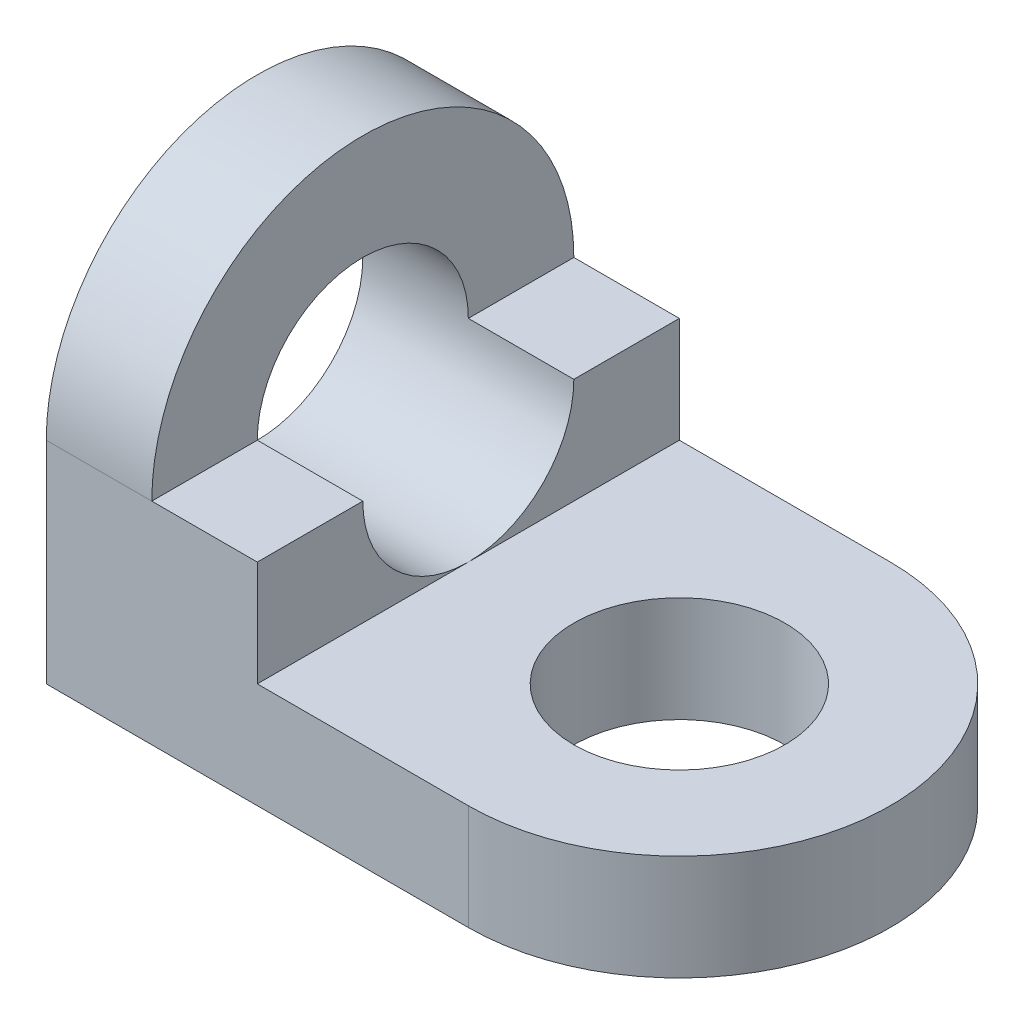
ISO-10303-21;
HEADER;
FILE_DESCRIPTION(('STEP AP214'),'2;1');
FILE_NAME('part.step','',(''),(''),'','','');
FILE_SCHEMA(('AUTOMOTIVE_DESIGN { 1 0 10303 214 1 1 1 1 }'));
ENDSEC;
DATA;
#1=APPLICATION_CONTEXT('core data for automotive mechanical design processes');
#2=APPLICATION_PROTOCOL_DEFINITION('international standard','automotive_design',2000,#1);
#3=PRODUCT_CONTEXT('',#1,'mechanical');
#4=PRODUCT('Part','Part','',(#3));
#5=PRODUCT_RELATED_PRODUCT_CATEGORY('part','',(#4));
#6=PRODUCT_DEFINITION_FORMATION('','',#4);
#7=PRODUCT_DEFINITION_CONTEXT('part definition',#1,'design');
#8=PRODUCT_DEFINITION('design','',#6,#7);
#9=PRODUCT_DEFINITION_SHAPE('','',#8);
#10=(LENGTH_UNIT() NAMED_UNIT(*) SI_UNIT(.MILLI.,.METRE.));
#11=(NAMED_UNIT(*) PLANE_ANGLE_UNIT() SI_UNIT($,.RADIAN.));
#12=(NAMED_UNIT(*) SI_UNIT($,.STERADIAN.) SOLID_ANGLE_UNIT());
#13=UNCERTAINTY_MEASURE_WITH_UNIT(LENGTH_MEASURE(1.E-05),#10,'distance_accuracy_value','');
#14=(GEOMETRIC_REPRESENTATION_CONTEXT(3) GLOBAL_UNCERTAINTY_ASSIGNED_CONTEXT((#13)) GLOBAL_UNIT_ASSIGNED_CONTEXT((#10,
#11,#12)) REPRESENTATION_CONTEXT('',''));
#15=CARTESIAN_POINT('',(0.,0.,0.));
#16=DIRECTION('',(0.,0.,1.));
#17=DIRECTION('',(1.,0.,0.));
#18=AXIS2_PLACEMENT_3D('',#15,#16,#17);
#19=CARTESIAN_POINT('',(1.,0.,0.));
#20=DIRECTION('',(1.,0.,0.));
#21=DIRECTION('',(0.,0.,-1.));
#22=AXIS2_PLACEMENT_3D('',#19,#20,#21);
#23=PLANE('',#22);
#24=DIRECTION('',(0.,0.,1.));
#25=VECTOR('',#24,1.);
#26=CARTESIAN_POINT('',(1.,2.,0.));
#27=LINE('',#26,#25);
#28=CARTESIAN_POINT('',(1.,2.,-2.));
#29=VERTEX_POINT('',#28);
#30=CARTESIAN_POINT('',(1.,2.,-1.));
#31=VERTEX_POINT('',#30);
#32=EDGE_CURVE('E204',#29,#31,#27,.T.);
#33=ORIENTED_EDGE('',*,*,#32,.F.);
#34=CARTESIAN_POINT('',(1.,2.,0.));
#35=DIRECTION('',(1.,0.,0.));
#36=DIRECTION('',(0.,0.,-1.));
#37=AXIS2_PLACEMENT_3D('',#34,#35,#36);
#38=CIRCLE('',#37,2.);
#39=CARTESIAN_POINT('',(1.,2.,2.));
#40=VERTEX_POINT('',#39);
#41=EDGE_CURVE('E215',#29,#40,#38,.T.);
#42=ORIENTED_EDGE('',*,*,#41,.T.);
#43=DIRECTION('',(0.,0.,-1.));
#44=VECTOR('',#43,1.);
#45=CARTESIAN_POINT('',(1.,2.,0.));
#46=LINE('',#45,#44);
#47=CARTESIAN_POINT('',(1.,2.,1.));
#48=VERTEX_POINT('',#47);
#49=EDGE_CURVE('E179',#40,#48,#46,.T.);
#50=ORIENTED_EDGE('',*,*,#49,.T.);
#51=CARTESIAN_POINT('',(1.,2.,0.));
#52=DIRECTION('',(1.,0.,0.));
#53=DIRECTION('',(0.,0.,-1.));
#54=AXIS2_PLACEMENT_3D('',#51,#52,#53);
#55=CIRCLE('',#54,1.);
#56=EDGE_CURVE('E208',#31,#48,#55,.T.);
#57=ORIENTED_EDGE('',*,*,#56,.F.);
#58=EDGE_LOOP('',(#33,#42,#50,#57));
#59=FACE_BOUND('',#58,.T.);
#60=ADVANCED_FACE('F91',(#59),#23,.T.);
#61=CARTESIAN_POINT('',(4.,1.,0.));
#62=DIRECTION('',(0.,1.,0.));
#63=DIRECTION('',(0.,0.,1.));
#64=AXIS2_PLACEMENT_3D('',#61,#62,#63);
#65=PLANE('',#64);
#66=DIRECTION('',(0.,0.,-1.));
#67=VECTOR('',#66,1.);
#68=CARTESIAN_POINT('',(2.,1.,0.));
#69=LINE('',#68,#67);
#70=CARTESIAN_POINT('',(2.,1.,2.));
#71=VERTEX_POINT('',#70);
#72=CARTESIAN_POINT('',(2.,1.,0.));
#73=VERTEX_POINT('',#72);
#74=EDGE_CURVE('E207',#71,#73,#69,.T.);
#75=ORIENTED_EDGE('',*,*,#74,.F.);
#76=DIRECTION('',(1.,0.,0.));
#77=VECTOR('',#76,1.);
#78=CARTESIAN_POINT('',(0.,1.,2.));
#79=LINE('',#78,#77);
#80=CARTESIAN_POINT('',(4.,1.,2.));
#81=VERTEX_POINT('',#80);
#82=EDGE_CURVE('E234',#71,#81,#79,.T.);
#83=ORIENTED_EDGE('',*,*,#82,.T.);
#84=CARTESIAN_POINT('',(4.,1.,0.));
#85=DIRECTION('',(0.,1.,0.));
#86=DIRECTION('',(0.,0.,1.));
#87=AXIS2_PLACEMENT_3D('',#84,#85,#86);
#88=CIRCLE('',#87,2.);
#89=CARTESIAN_POINT('',(4.,1.,-2.));
#90=VERTEX_POINT('',#89);
#91=EDGE_CURVE('E230',#81,#90,#88,.T.);
#92=ORIENTED_EDGE('',*,*,#91,.T.);
#93=DIRECTION('',(-1.,0.,0.));
#94=VECTOR('',#93,1.);
#95=CARTESIAN_POINT('',(4.,1.,-2.));
#96=LINE('',#95,#94);
#97=CARTESIAN_POINT('',(2.,1.,-2.));
#98=VERTEX_POINT('',#97);
#99=EDGE_CURVE('E111',#90,#98,#96,.T.);
#100=ORIENTED_EDGE('',*,*,#99,.T.);
#101=EDGE_CURVE('E106',#73,#98,#69,.T.);
#102=ORIENTED_EDGE('',*,*,#101,.F.);
#103=EDGE_LOOP('',(#75,#83,#92,#100,#102));
#104=FACE_BOUND('',#103,.T.);
#105=CARTESIAN_POINT('',(4.,1.,0.));
#106=DIRECTION('',(0.,1.,0.));
#107=DIRECTION('',(0.,0.,1.));
#108=AXIS2_PLACEMENT_3D('',#105,#106,#107);
#109=CIRCLE('',#108,1.);
#110=CARTESIAN_POINT('',(4.,1.,1.));
#111=VERTEX_POINT('',#110);
#112=EDGE_CURVE('E224',#111,#111,#109,.T.);
#113=ORIENTED_EDGE('',*,*,#112,.F.);
#114=EDGE_LOOP('',(#113));
#115=FACE_BOUND('',#114,.T.);
#116=ADVANCED_FACE('F265',(#104,#115),#65,.T.);
#117=CARTESIAN_POINT('',(4.,0.,0.));
#118=DIRECTION('',(0.,1.,0.));
#119=DIRECTION('',(0.,0.,1.));
#120=AXIS2_PLACEMENT_3D('',#117,#118,#119);
#121=PLANE('',#120);
#122=CARTESIAN_POINT('',(4.,0.,0.));
#123=DIRECTION('',(0.,1.,0.));
#124=DIRECTION('',(0.,0.,1.));
#125=AXIS2_PLACEMENT_3D('',#122,#123,#124);
#126=CIRCLE('',#125,2.);
#127=CARTESIAN_POINT('',(4.,0.,2.));
#128=VERTEX_POINT('',#127);
#129=CARTESIAN_POINT('',(4.,0.,-2.));
#130=VERTEX_POINT('',#129);
#131=EDGE_CURVE('E227',#128,#130,#126,.T.);
#132=ORIENTED_EDGE('',*,*,#131,.F.);
#133=DIRECTION('',(1.,0.,0.));
#134=VECTOR('',#133,1.);
#135=CARTESIAN_POINT('',(0.,0.,2.));
#136=LINE('',#135,#134);
#137=CARTESIAN_POINT('',(0.,0.,2.));
#138=VERTEX_POINT('',#137);
#139=EDGE_CURVE('E232',#138,#128,#136,.T.);
#140=ORIENTED_EDGE('',*,*,#139,.F.);
#141=DIRECTION('',(0.,0.,1.));
#142=VECTOR('',#141,1.);
#143=CARTESIAN_POINT('',(0.,0.,-2.));
#144=LINE('',#143,#142);
#145=CARTESIAN_POINT('',(0.,0.,-2.));
#146=VERTEX_POINT('',#145);
#147=EDGE_CURVE('E241',#146,#138,#144,.T.);
#148=ORIENTED_EDGE('',*,*,#147,.F.);
#149=DIRECTION('',(-1.,0.,0.));
#150=VECTOR('',#149,1.);
#151=CARTESIAN_POINT('',(4.,0.,-2.));
#152=LINE('',#151,#150);
#153=EDGE_CURVE('E239',#130,#146,#152,.T.);
#154=ORIENTED_EDGE('',*,*,#153,.F.);
#155=EDGE_LOOP('',(#132,#140,#148,#154));
#156=FACE_BOUND('',#155,.T.);
#157=CARTESIAN_POINT('',(4.,0.,0.));
#158=DIRECTION('',(0.,1.,0.));
#159=DIRECTION('',(0.,0.,1.));
#160=AXIS2_PLACEMENT_3D('',#157,#158,#159);
#161=CIRCLE('',#160,1.);
#162=CARTESIAN_POINT('',(4.,0.,1.));
#163=VERTEX_POINT('',#162);
#164=EDGE_CURVE('E223',#163,#163,#161,.T.);
#165=ORIENTED_EDGE('',*,*,#164,.T.);
#166=EDGE_LOOP('',(#165));
#167=FACE_BOUND('',#166,.T.);
#168=ADVANCED_FACE('F256',(#156,#167),#121,.F.);
#169=CARTESIAN_POINT('',(4.,1.,0.));
#170=DIRECTION('',(0.,-1.,0.));
#171=DIRECTION('',(0.,0.,-1.));
#172=AXIS2_PLACEMENT_3D('',#169,#170,#171);
#173=CYLINDRICAL_SURFACE('',#172,2.);
#174=ORIENTED_EDGE('',*,*,#131,.T.);
#175=DIRECTION('',(0.,-1.,0.));
#176=VECTOR('',#175,1.);
#177=CARTESIAN_POINT('',(4.,1.,-2.));
#178=LINE('',#177,#176);
#179=EDGE_CURVE('E12',#90,#130,#178,.T.);
#180=ORIENTED_EDGE('',*,*,#179,.F.);
#181=ORIENTED_EDGE('',*,*,#91,.F.);
#182=DIRECTION('',(0.,-1.,0.));
#183=VECTOR('',#182,1.);
#184=CARTESIAN_POINT('',(4.,1.,2.));
#185=LINE('',#184,#183);
#186=EDGE_CURVE('E236',#81,#128,#185,.T.);
#187=ORIENTED_EDGE('',*,*,#186,.T.);
#188=EDGE_LOOP('',(#174,#180,#181,#187));
#189=FACE_BOUND('',#188,.T.);
#190=ADVANCED_FACE('F93',(#189),#173,.T.);
#191=CARTESIAN_POINT('',(4.,1.,-2.));
#192=DIRECTION('',(0.,0.,1.));
#193=DIRECTION('',(1.,0.,0.));
#194=AXIS2_PLACEMENT_3D('',#191,#192,#193);
#195=PLANE('',#194);
#196=DIRECTION('',(0.,1.,0.));
#197=VECTOR('',#196,1.);
#198=CARTESIAN_POINT('',(2.,0.,-2.));
#199=LINE('',#198,#197);
#200=CARTESIAN_POINT('',(2.,2.,-2.));
#201=VERTEX_POINT('',#200);
#202=EDGE_CURVE('E163',#98,#201,#199,.T.);
#203=ORIENTED_EDGE('',*,*,#202,.F.);
#204=ORIENTED_EDGE('',*,*,#99,.F.);
#205=ORIENTED_EDGE('',*,*,#179,.T.);
#206=ORIENTED_EDGE('',*,*,#153,.T.);
#207=DIRECTION('',(0.,-1.,0.));
#208=VECTOR('',#207,1.);
#209=CARTESIAN_POINT('',(0.,1.,-2.));
#210=LINE('',#209,#208);
#211=CARTESIAN_POINT('',(0.,2.,-2.));
#212=VERTEX_POINT('',#211);
#213=EDGE_CURVE('E99',#212,#146,#210,.T.);
#214=ORIENTED_EDGE('',*,*,#213,.F.);
#215=DIRECTION('',(-1.,0.,0.));
#216=VECTOR('',#215,1.);
#217=CARTESIAN_POINT('',(1.,2.,-2.));
#218=LINE('',#217,#216);
#219=EDGE_CURVE('E176',#29,#212,#218,.T.);
#220=ORIENTED_EDGE('',*,*,#219,.F.);
#221=DIRECTION('',(-1.,0.,0.));
#222=VECTOR('',#221,1.);
#223=CARTESIAN_POINT('',(2.,2.,-2.));
#224=LINE('',#223,#222);
#225=EDGE_CURVE('E173',#201,#29,#224,.T.);
#226=ORIENTED_EDGE('',*,*,#225,.F.);
#227=EDGE_LOOP('',(#203,#204,#205,#206,#214,#220,#226));
#228=FACE_BOUND('',#227,.T.);
#229=ADVANCED_FACE('F174',(#228),#195,.F.);
#230=CARTESIAN_POINT('',(0.,1.,-2.));
#231=DIRECTION('',(1.,0.,0.));
#232=DIRECTION('',(0.,0.,-1.));
#233=AXIS2_PLACEMENT_3D('',#230,#231,#232);
#234=PLANE('',#233);
#235=CARTESIAN_POINT('',(0.,2.,0.));
#236=DIRECTION('',(1.,0.,0.));
#237=DIRECTION('',(0.,0.,-1.));
#238=AXIS2_PLACEMENT_3D('',#235,#236,#237);
#239=CIRCLE('',#238,1.);
#240=CARTESIAN_POINT('',(0.,2.,-1.));
#241=VERTEX_POINT('',#240);
#242=EDGE_CURVE('E212',#241,#241,#239,.T.);
#243=ORIENTED_EDGE('',*,*,#242,.T.);
#244=EDGE_LOOP('',(#243));
#245=FACE_BOUND('',#244,.T.);
#246=CARTESIAN_POINT('',(0.,2.,0.));
#247=DIRECTION('',(1.,0.,0.));
#248=DIRECTION('',(0.,0.,-1.));
#249=AXIS2_PLACEMENT_3D('',#246,#247,#248);
#250=CIRCLE('',#249,2.);
#251=CARTESIAN_POINT('',(0.,2.,2.));
#252=VERTEX_POINT('',#251);
#253=EDGE_CURVE('E211',#212,#252,#250,.T.);
#254=ORIENTED_EDGE('',*,*,#253,.F.);
#255=ORIENTED_EDGE('',*,*,#213,.T.);
#256=ORIENTED_EDGE('',*,*,#147,.T.);
#257=DIRECTION('',(0.,-1.,0.));
#258=VECTOR('',#257,1.);
#259=CARTESIAN_POINT('',(0.,1.,2.));
#260=LINE('',#259,#258);
#261=EDGE_CURVE('E246',#252,#138,#260,.T.);
#262=ORIENTED_EDGE('',*,*,#261,.F.);
#263=EDGE_LOOP('',(#254,#255,#256,#262));
#264=FACE_BOUND('',#263,.T.);
#265=ADVANCED_FACE('F252',(#245,#264),#234,.F.);
#266=CARTESIAN_POINT('',(0.,1.,2.));
#267=DIRECTION('',(0.,0.,-1.));
#268=DIRECTION('',(-1.,0.,0.));
#269=AXIS2_PLACEMENT_3D('',#266,#267,#268);
#270=PLANE('',#269);
#271=ORIENTED_EDGE('',*,*,#82,.F.);
#272=DIRECTION('',(0.,-1.,0.));
#273=VECTOR('',#272,1.);
#274=CARTESIAN_POINT('',(2.,0.,2.));
#275=LINE('',#274,#273);
#276=CARTESIAN_POINT('',(2.,2.,2.));
#277=VERTEX_POINT('',#276);
#278=EDGE_CURVE('E193',#277,#71,#275,.T.);
#279=ORIENTED_EDGE('',*,*,#278,.F.);
#280=DIRECTION('',(-1.,0.,0.));
#281=VECTOR('',#280,1.);
#282=CARTESIAN_POINT('',(2.,2.,2.));
#283=LINE('',#282,#281);
#284=EDGE_CURVE('E196',#277,#40,#283,.T.);
#285=ORIENTED_EDGE('',*,*,#284,.T.);
#286=DIRECTION('',(-1.,0.,0.));
#287=VECTOR('',#286,1.);
#288=CARTESIAN_POINT('',(1.,2.,2.));
#289=LINE('',#288,#287);
#290=EDGE_CURVE('E217',#40,#252,#289,.T.);
#291=ORIENTED_EDGE('',*,*,#290,.T.);
#292=ORIENTED_EDGE('',*,*,#261,.T.);
#293=ORIENTED_EDGE('',*,*,#139,.T.);
#294=ORIENTED_EDGE('',*,*,#186,.F.);
#295=EDGE_LOOP('',(#271,#279,#285,#291,#292,#293,#294));
#296=FACE_BOUND('',#295,.T.);
#297=ADVANCED_FACE('F261',(#296),#270,.F.);
#298=CARTESIAN_POINT('',(4.,1.,0.));
#299=DIRECTION('',(0.,-1.,0.));
#300=DIRECTION('',(0.,0.,-1.));
#301=AXIS2_PLACEMENT_3D('',#298,#299,#300);
#302=CYLINDRICAL_SURFACE('',#301,1.);
#303=ORIENTED_EDGE('',*,*,#112,.T.);
#304=EDGE_LOOP('',(#303));
#305=FACE_BOUND('',#304,.T.);
#306=ORIENTED_EDGE('',*,*,#164,.F.);
#307=EDGE_LOOP('',(#306));
#308=FACE_BOUND('',#307,.T.);
#309=ADVANCED_FACE('F294',(#305,#308),#302,.F.);
#310=CARTESIAN_POINT('',(1.,2.,0.));
#311=DIRECTION('',(-1.,0.,0.));
#312=DIRECTION('',(0.,0.,1.));
#313=AXIS2_PLACEMENT_3D('',#310,#311,#312);
#314=CYLINDRICAL_SURFACE('',#313,2.);
#315=ORIENTED_EDGE('',*,*,#253,.T.);
#316=ORIENTED_EDGE('',*,*,#290,.F.);
#317=ORIENTED_EDGE('',*,*,#41,.F.);
#318=ORIENTED_EDGE('',*,*,#219,.T.);
#319=EDGE_LOOP('',(#315,#316,#317,#318));
#320=FACE_BOUND('',#319,.T.);
#321=ADVANCED_FACE('F279',(#320),#314,.T.);
#322=CARTESIAN_POINT('',(1.,2.,0.));
#323=DIRECTION('',(-1.,0.,0.));
#324=DIRECTION('',(0.,0.,1.));
#325=AXIS2_PLACEMENT_3D('',#322,#323,#324);
#326=CYLINDRICAL_SURFACE('',#325,1.);
#327=CARTESIAN_POINT('',(2.,2.,0.));
#328=DIRECTION('',(1.,0.,0.));
#329=DIRECTION('',(0.,0.,-1.));
#330=AXIS2_PLACEMENT_3D('',#327,#328,#329);
#331=CIRCLE('',#330,1.);
#332=CARTESIAN_POINT('',(2.,2.,1.));
#333=VERTEX_POINT('',#332);
#334=EDGE_CURVE('E187',#333,#73,#331,.T.);
#335=ORIENTED_EDGE('',*,*,#334,.T.);
#336=CARTESIAN_POINT('',(2.,2.,-1.));
#337=VERTEX_POINT('',#336);
#338=EDGE_CURVE('E185',#73,#337,#331,.T.);
#339=ORIENTED_EDGE('',*,*,#338,.T.);
#340=DIRECTION('',(-1.,0.,0.));
#341=VECTOR('',#340,1.);
#342=CARTESIAN_POINT('',(2.,2.,-1.));
#343=LINE('',#342,#341);
#344=EDGE_CURVE('E180',#337,#31,#343,.T.);
#345=ORIENTED_EDGE('',*,*,#344,.T.);
#346=ORIENTED_EDGE('',*,*,#56,.T.);
#347=DIRECTION('',(-1.,0.,0.));
#348=VECTOR('',#347,1.);
#349=CARTESIAN_POINT('',(2.,2.,1.));
#350=LINE('',#349,#348);
#351=EDGE_CURVE('E199',#333,#48,#350,.T.);
#352=ORIENTED_EDGE('',*,*,#351,.F.);
#353=EDGE_LOOP('',(#335,#339,#345,#346,#352));
#354=FACE_BOUND('',#353,.T.);
#355=ORIENTED_EDGE('',*,*,#242,.F.);
#356=EDGE_LOOP('',(#355));
#357=FACE_BOUND('',#356,.T.);
#358=ADVANCED_FACE('F282',(#354,#357),#326,.F.);
#359=CARTESIAN_POINT('',(2.,0.,0.));
#360=DIRECTION('',(1.,0.,0.));
#361=DIRECTION('',(0.,0.,-1.));
#362=AXIS2_PLACEMENT_3D('',#359,#360,#361);
#363=PLANE('',#362);
#364=ORIENTED_EDGE('',*,*,#278,.T.);
#365=ORIENTED_EDGE('',*,*,#74,.T.);
#366=ORIENTED_EDGE('',*,*,#334,.F.);
#367=DIRECTION('',(0.,0.,1.));
#368=VECTOR('',#367,1.);
#369=CARTESIAN_POINT('',(2.,2.,0.));
#370=LINE('',#369,#368);
#371=EDGE_CURVE('E191',#333,#277,#370,.T.);
#372=ORIENTED_EDGE('',*,*,#371,.T.);
#373=EDGE_LOOP('',(#364,#365,#366,#372));
#374=FACE_BOUND('',#373,.T.);
#375=ADVANCED_FACE('F269',(#374),#363,.T.);
#376=CARTESIAN_POINT('',(2.,2.,0.));
#377=DIRECTION('',(0.,1.,0.));
#378=DIRECTION('',(0.,0.,1.));
#379=AXIS2_PLACEMENT_3D('',#376,#377,#378);
#380=PLANE('',#379);
#381=ORIENTED_EDGE('',*,*,#225,.T.);
#382=ORIENTED_EDGE('',*,*,#32,.T.);
#383=ORIENTED_EDGE('',*,*,#344,.F.);
#384=DIRECTION('',(0.,0.,-1.));
#385=VECTOR('',#384,1.);
#386=CARTESIAN_POINT('',(2.,2.,0.));
#387=LINE('',#386,#385);
#388=EDGE_CURVE('E168',#337,#201,#387,.T.);
#389=ORIENTED_EDGE('',*,*,#388,.T.);
#390=EDGE_LOOP('',(#381,#382,#383,#389));
#391=FACE_BOUND('',#390,.T.);
#392=ADVANCED_FACE('F183',(#391),#380,.T.);
#393=CARTESIAN_POINT('',(2.,2.,0.));
#394=DIRECTION('',(0.,-1.,0.));
#395=DIRECTION('',(0.,0.,-1.));
#396=AXIS2_PLACEMENT_3D('',#393,#394,#395);
#397=PLANE('',#396);
#398=ORIENTED_EDGE('',*,*,#49,.F.);
#399=ORIENTED_EDGE('',*,*,#284,.F.);
#400=ORIENTED_EDGE('',*,*,#371,.F.);
#401=ORIENTED_EDGE('',*,*,#351,.T.);
#402=EDGE_LOOP('',(#398,#399,#400,#401));
#403=FACE_BOUND('',#402,.T.);
#404=ADVANCED_FACE('F275',(#403),#397,.F.);
#405=ORIENTED_EDGE('',*,*,#338,.F.);
#406=ORIENTED_EDGE('',*,*,#101,.T.);
#407=ORIENTED_EDGE('',*,*,#202,.T.);
#408=ORIENTED_EDGE('',*,*,#388,.F.);
#409=EDGE_LOOP('',(#405,#406,#407,#408));
#410=FACE_BOUND('',#409,.T.);
#411=ADVANCED_FACE('F166',(#410),#363,.T.);
#412=CLOSED_SHELL('',(#60,#116,#168,#190,#229,#265,#297,#309,#321,#358,#375,#392,#404,#411));
#413=MANIFOLD_SOLID_BREP('B2',#412);
#414=ADVANCED_BREP_SHAPE_REPRESENTATION('',(#18,#413),#14);
#415=SHAPE_DEFINITION_REPRESENTATION(#9,#414);
ENDSEC;
END-ISO-10303-21;
